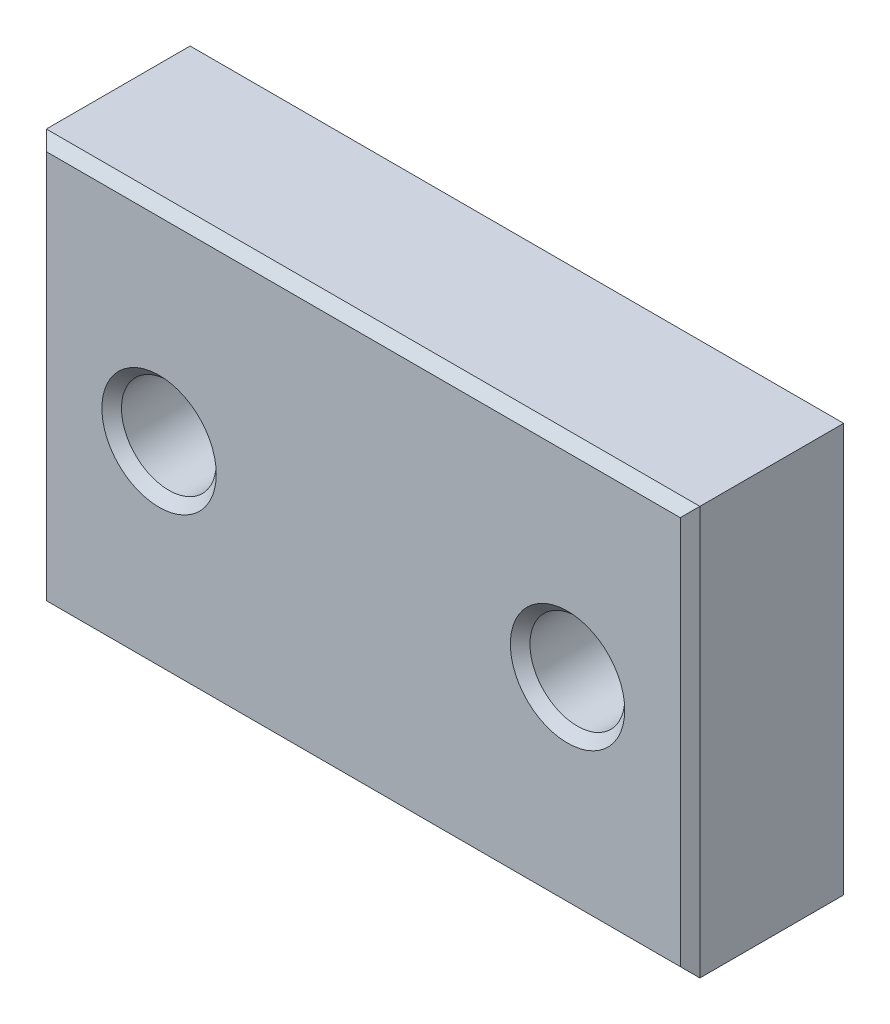
ISO-10303-21;
HEADER;
FILE_DESCRIPTION(('STEP AP214'),'2;1');
FILE_NAME('part.step','',(''),(''),'','','');
FILE_SCHEMA(('AUTOMOTIVE_DESIGN { 1 0 10303 214 1 1 1 1 }'));
ENDSEC;
DATA;
#1=APPLICATION_CONTEXT('core data for automotive mechanical design processes');
#2=APPLICATION_PROTOCOL_DEFINITION('international standard','automotive_design',2000,#1);
#3=PRODUCT_CONTEXT('',#1,'mechanical');
#4=PRODUCT('Part','Part','',(#3));
#5=PRODUCT_RELATED_PRODUCT_CATEGORY('part','',(#4));
#6=PRODUCT_DEFINITION_FORMATION('','',#4);
#7=PRODUCT_DEFINITION_CONTEXT('part definition',#1,'design');
#8=PRODUCT_DEFINITION('design','',#6,#7);
#9=PRODUCT_DEFINITION_SHAPE('','',#8);
#10=(LENGTH_UNIT() NAMED_UNIT(*) SI_UNIT(.MILLI.,.METRE.));
#11=(NAMED_UNIT(*) PLANE_ANGLE_UNIT() SI_UNIT($,.RADIAN.));
#12=(NAMED_UNIT(*) SI_UNIT($,.STERADIAN.) SOLID_ANGLE_UNIT());
#13=UNCERTAINTY_MEASURE_WITH_UNIT(LENGTH_MEASURE(1.E-05),#10,'distance_accuracy_value','');
#14=(GEOMETRIC_REPRESENTATION_CONTEXT(3) GLOBAL_UNCERTAINTY_ASSIGNED_CONTEXT((#13)) GLOBAL_UNIT_ASSIGNED_CONTEXT((#10,
#11,#12)) REPRESENTATION_CONTEXT('',''));
#15=CARTESIAN_POINT('',(0.,0.,0.));
#16=DIRECTION('',(0.,0.,1.));
#17=DIRECTION('',(1.,0.,0.));
#18=AXIS2_PLACEMENT_3D('',#15,#16,#17);
#19=CARTESIAN_POINT('',(12.7,-9.7417824240334,0.));
#20=DIRECTION('',(0.,0.,1.));
#21=DIRECTION('',(1.,0.,0.));
#22=AXIS2_PLACEMENT_3D('',#19,#20,#21);
#23=PLANE('',#22);
#24=CARTESIAN_POINT('',(4.7625,-9.7417824240334,-2.27373675443232E-10));
#25=DIRECTION('',(0.,0.,-1.));
#26=DIRECTION('',(-1.,0.,0.));
#27=AXIS2_PLACEMENT_3D('',#24,#25,#26);
#28=CIRCLE('',#27,2.2224999998155);
#29=CARTESIAN_POINT('',(2.5400000001845,-9.7417824240334,-2.27373675443232E-10));
#30=VERTEX_POINT('',#29);
#31=EDGE_CURVE('E21',#30,#30,#28,.F.);
#32=ORIENTED_EDGE('',*,*,#31,.T.);
#33=EDGE_LOOP('',(#32));
#34=FACE_BOUND('',#33,.T.);
#35=CARTESIAN_POINT('',(20.6375,-9.7417824240334,-1.70530256582424E-10));
#36=DIRECTION('',(0.,0.,-1.));
#37=DIRECTION('',(-1.,0.,0.));
#38=AXIS2_PLACEMENT_3D('',#35,#36,#37);
#39=CIRCLE('',#38,2.22249999975274);
#40=CARTESIAN_POINT('',(18.4150000002473,-9.7417824240334,-1.70530256582424E-10));
#41=VERTEX_POINT('',#40);
#42=EDGE_CURVE('E109',#41,#41,#39,.F.);
#43=ORIENTED_EDGE('',*,*,#42,.T.);
#44=EDGE_LOOP('',(#43));
#45=FACE_BOUND('',#44,.T.);
#46=DIRECTION('',(0.,1.,0.));
#47=VECTOR('',#46,1.);
#48=CARTESIAN_POINT('',(25.019,-5.7730324240334,0.));
#49=LINE('',#48,#47);
#50=CARTESIAN_POINT('',(25.019,-17.2982824240334,0.));
#51=VERTEX_POINT('',#50);
#52=CARTESIAN_POINT('',(25.019,-2.1852824240334,0.));
#53=VERTEX_POINT('',#52);
#54=EDGE_CURVE('E81',#51,#53,#49,.T.);
#55=ORIENTED_EDGE('',*,*,#54,.F.);
#56=DIRECTION('',(1.,0.,0.));
#57=VECTOR('',#56,1.);
#58=CARTESIAN_POINT('',(19.05,-17.2982824240334,0.));
#59=LINE('',#58,#57);
#60=CARTESIAN_POINT('',(0.381,-17.2982824240334,0.));
#61=VERTEX_POINT('',#60);
#62=EDGE_CURVE('E86',#61,#51,#59,.T.);
#63=ORIENTED_EDGE('',*,*,#62,.F.);
#64=DIRECTION('',(0.,1.,0.));
#65=VECTOR('',#64,1.);
#66=CARTESIAN_POINT('',(0.381,-13.7105324240334,0.));
#67=LINE('',#66,#65);
#68=CARTESIAN_POINT('',(0.380999999999999,-2.1852824240334,0.));
#69=VERTEX_POINT('',#68);
#70=EDGE_CURVE('E118',#69,#61,#67,.F.);
#71=ORIENTED_EDGE('',*,*,#70,.F.);
#72=DIRECTION('',(1.,0.,0.));
#73=VECTOR('',#72,1.);
#74=CARTESIAN_POINT('',(6.35,-2.1852824240334,0.));
#75=LINE('',#74,#73);
#76=EDGE_CURVE('E96',#53,#69,#75,.F.);
#77=ORIENTED_EDGE('',*,*,#76,.F.);
#78=EDGE_LOOP('',(#55,#63,#71,#77));
#79=FACE_BOUND('',#78,.T.);
#80=ADVANCED_FACE('F17',(#34,#45,#79),#23,.F.);
#81=CARTESIAN_POINT('',(19.05,-17.4887824240334,0.1905));
#82=DIRECTION('',(0.,-0.707106781186547,-0.707106781186548));
#83=DIRECTION('',(0.,0.707106781186548,-0.707106781186547));
#84=AXIS2_PLACEMENT_3D('',#81,#82,#83);
#85=PLANE('',#84);
#86=ORIENTED_EDGE('',*,*,#62,.T.);
#87=DIRECTION('',(-0.577350269189624,0.577350269189629,-0.577350269189624));
#88=VECTOR('',#87,1.);
#89=CARTESIAN_POINT('',(25.4,-17.6792824240334,0.381));
#90=LINE('',#89,#88);
#91=CARTESIAN_POINT('',(25.4,-17.6792824240334,0.381000000000001));
#92=VERTEX_POINT('',#91);
#93=EDGE_CURVE('E88',#92,#51,#90,.T.);
#94=ORIENTED_EDGE('',*,*,#93,.F.);
#95=DIRECTION('',(1.,0.,0.));
#96=VECTOR('',#95,1.);
#97=CARTESIAN_POINT('',(25.4,-17.6792824240334,0.381));
#98=LINE('',#97,#96);
#99=CARTESIAN_POINT('',(0.,-17.6792824240334,0.381000000000001));
#100=VERTEX_POINT('',#99);
#101=EDGE_CURVE('E111',#100,#92,#98,.T.);
#102=ORIENTED_EDGE('',*,*,#101,.F.);
#103=DIRECTION('',(-0.577350269189625,-0.577350269189629,0.577350269189624));
#104=VECTOR('',#103,1.);
#105=CARTESIAN_POINT('',(0.381,-17.2982824240334,0.));
#106=LINE('',#105,#104);
#107=EDGE_CURVE('E91',#61,#100,#106,.T.);
#108=ORIENTED_EDGE('',*,*,#107,.F.);
#109=EDGE_LOOP('',(#86,#94,#102,#108));
#110=FACE_BOUND('',#109,.T.);
#111=ADVANCED_FACE('F87',(#110),#85,.T.);
#112=CARTESIAN_POINT('',(25.2095,-5.7730324240334,0.1905));
#113=DIRECTION('',(0.707106781186547,0.,-0.707106781186548));
#114=DIRECTION('',(-0.707106781186548,0.,-0.707106781186547));
#115=AXIS2_PLACEMENT_3D('',#112,#113,#114);
#116=PLANE('',#115);
#117=ORIENTED_EDGE('',*,*,#54,.T.);
#118=DIRECTION('',(-0.577350269189625,-0.577350269189627,-0.577350269189626));
#119=VECTOR('',#118,1.);
#120=CARTESIAN_POINT('',(25.4,-1.8042824240334,0.381));
#121=LINE('',#120,#119);
#122=CARTESIAN_POINT('',(25.4,-1.8042824240334,0.381));
#123=VERTEX_POINT('',#122);
#124=EDGE_CURVE('E98',#123,#53,#121,.T.);
#125=ORIENTED_EDGE('',*,*,#124,.F.);
#126=DIRECTION('',(0.,1.,0.));
#127=VECTOR('',#126,1.);
#128=CARTESIAN_POINT('',(25.4,-1.8042824240334,0.381));
#129=LINE('',#128,#127);
#130=EDGE_CURVE('E102',#92,#123,#129,.T.);
#131=ORIENTED_EDGE('',*,*,#130,.F.);
#132=ORIENTED_EDGE('',*,*,#93,.T.);
#133=EDGE_LOOP('',(#117,#125,#131,#132));
#134=FACE_BOUND('',#133,.T.);
#135=ADVANCED_FACE('F100',(#134),#116,.T.);
#136=CARTESIAN_POINT('',(6.35,-1.9947824240334,0.1905));
#137=DIRECTION('',(0.,0.707106781186547,-0.707106781186548));
#138=DIRECTION('',(0.,0.707106781186548,0.707106781186547));
#139=AXIS2_PLACEMENT_3D('',#136,#137,#138);
#140=PLANE('',#139);
#141=ORIENTED_EDGE('',*,*,#76,.T.);
#142=DIRECTION('',(0.577350269189627,-0.577350269189625,-0.577350269189626));
#143=VECTOR('',#142,1.);
#144=CARTESIAN_POINT('',(0.,-1.8042824240334,0.381));
#145=LINE('',#144,#143);
#146=CARTESIAN_POINT('',(0.,-1.8042824240334,0.381));
#147=VERTEX_POINT('',#146);
#148=EDGE_CURVE('E123',#147,#69,#145,.T.);
#149=ORIENTED_EDGE('',*,*,#148,.F.);
#150=DIRECTION('',(1.,0.,0.));
#151=VECTOR('',#150,1.);
#152=CARTESIAN_POINT('',(0.,-1.8042824240334,0.381));
#153=LINE('',#152,#151);
#154=EDGE_CURVE('E133',#123,#147,#153,.F.);
#155=ORIENTED_EDGE('',*,*,#154,.F.);
#156=ORIENTED_EDGE('',*,*,#124,.T.);
#157=EDGE_LOOP('',(#141,#149,#155,#156));
#158=FACE_BOUND('',#157,.T.);
#159=ADVANCED_FACE('F131',(#158),#140,.T.);
#160=CARTESIAN_POINT('',(0.1905,-13.7105324240334,0.1905));
#161=DIRECTION('',(-0.707106781186547,0.,-0.707106781186548));
#162=DIRECTION('',(-0.707106781186548,0.,0.707106781186547));
#163=AXIS2_PLACEMENT_3D('',#160,#161,#162);
#164=PLANE('',#163);
#165=ORIENTED_EDGE('',*,*,#70,.T.);
#166=ORIENTED_EDGE('',*,*,#107,.T.);
#167=DIRECTION('',(0.,1.,0.));
#168=VECTOR('',#167,1.);
#169=CARTESIAN_POINT('',(0.,-17.6792824240334,0.381));
#170=LINE('',#169,#168);
#171=EDGE_CURVE('E149',#147,#100,#170,.F.);
#172=ORIENTED_EDGE('',*,*,#171,.F.);
#173=ORIENTED_EDGE('',*,*,#148,.T.);
#174=EDGE_LOOP('',(#165,#166,#172,#173));
#175=FACE_BOUND('',#174,.T.);
#176=ADVANCED_FACE('F270',(#175),#164,.T.);
#177=CARTESIAN_POINT('',(4.7625,-9.7417824240334,-1.70530256582424E-10));
#178=DIRECTION('',(0.,0.,-1.));
#179=DIRECTION('',(-1.,0.,0.));
#180=AXIS2_PLACEMENT_3D('',#177,#178,#179);
#181=CONICAL_SURFACE('',#180,2.22249999975866,0.785398162502276);
#182=ORIENTED_EDGE('',*,*,#31,.F.);
#183=EDGE_LOOP('',(#182));
#184=FACE_BOUND('',#183,.T.);
#185=CARTESIAN_POINT('',(4.7625,-9.7417824240334,0.381));
#186=DIRECTION('',(0.,0.,1.));
#187=DIRECTION('',(1.,0.,0.));
#188=AXIS2_PLACEMENT_3D('',#185,#186,#187);
#189=CIRCLE('',#188,1.8415);
#190=CARTESIAN_POINT('',(6.604,-9.7417824240334,0.381));
#191=VERTEX_POINT('',#190);
#192=EDGE_CURVE('E160',#191,#191,#189,.T.);
#193=ORIENTED_EDGE('',*,*,#192,.T.);
#194=EDGE_LOOP('',(#193));
#195=FACE_BOUND('',#194,.T.);
#196=ADVANCED_FACE('F273',(#184,#195),#181,.F.);
#197=CARTESIAN_POINT('',(20.6375,-9.7417824240334,-1.70530256582424E-10));
#198=DIRECTION('',(0.,0.,-1.));
#199=DIRECTION('',(-1.,0.,0.));
#200=AXIS2_PLACEMENT_3D('',#197,#198,#199);
#201=CONICAL_SURFACE('',#200,2.22249999975274,0.785398162427679);
#202=ORIENTED_EDGE('',*,*,#42,.F.);
#203=EDGE_LOOP('',(#202));
#204=FACE_BOUND('',#203,.T.);
#205=CARTESIAN_POINT('',(20.6375,-9.7417824240334,0.381));
#206=DIRECTION('',(0.,0.,1.));
#207=DIRECTION('',(1.,0.,0.));
#208=AXIS2_PLACEMENT_3D('',#205,#206,#207);
#209=CIRCLE('',#208,1.8415);
#210=CARTESIAN_POINT('',(22.479,-9.7417824240334,0.381));
#211=VERTEX_POINT('',#210);
#212=EDGE_CURVE('E165',#211,#211,#209,.T.);
#213=ORIENTED_EDGE('',*,*,#212,.T.);
#214=EDGE_LOOP('',(#213));
#215=FACE_BOUND('',#214,.T.);
#216=ADVANCED_FACE('F276',(#204,#215),#201,.F.);
#217=CARTESIAN_POINT('',(25.4,-17.6792824240334,0.));
#218=DIRECTION('',(0.,-1.,0.));
#219=DIRECTION('',(0.,0.,-1.));
#220=AXIS2_PLACEMENT_3D('',#217,#218,#219);
#221=PLANE('',#220);
#222=DIRECTION('',(1.,0.,0.));
#223=VECTOR('',#222,1.);
#224=CARTESIAN_POINT('',(19.05,-17.6792824240334,5.969));
#225=LINE('',#224,#223);
#226=CARTESIAN_POINT('',(0.,-17.6792824240334,5.969));
#227=VERTEX_POINT('',#226);
#228=CARTESIAN_POINT('',(25.4,-17.6792824240334,5.969));
#229=VERTEX_POINT('',#228);
#230=EDGE_CURVE('E170',#227,#229,#225,.T.);
#231=ORIENTED_EDGE('',*,*,#230,.F.);
#232=DIRECTION('',(0.,0.,1.));
#233=VECTOR('',#232,1.);
#234=CARTESIAN_POINT('',(0.,-17.6792824240334,0.));
#235=LINE('',#234,#233);
#236=EDGE_CURVE('E152',#100,#227,#235,.T.);
#237=ORIENTED_EDGE('',*,*,#236,.F.);
#238=ORIENTED_EDGE('',*,*,#101,.T.);
#239=DIRECTION('',(0.,0.,-1.));
#240=VECTOR('',#239,1.);
#241=CARTESIAN_POINT('',(25.4,-17.6792824240334,0.));
#242=LINE('',#241,#240);
#243=EDGE_CURVE('E138',#229,#92,#242,.T.);
#244=ORIENTED_EDGE('',*,*,#243,.F.);
#245=EDGE_LOOP('',(#231,#237,#238,#244));
#246=FACE_BOUND('',#245,.T.);
#247=ADVANCED_FACE('F280',(#246),#221,.T.);
#248=CARTESIAN_POINT('',(25.4,-1.8042824240334,0.));
#249=DIRECTION('',(1.,0.,0.));
#250=DIRECTION('',(0.,0.,-1.));
#251=AXIS2_PLACEMENT_3D('',#248,#249,#250);
#252=PLANE('',#251);
#253=DIRECTION('',(0.,1.,0.));
#254=VECTOR('',#253,1.);
#255=CARTESIAN_POINT('',(25.4,-5.7730324240334,5.969));
#256=LINE('',#255,#254);
#257=CARTESIAN_POINT('',(25.4,-1.8042824240334,5.969));
#258=VERTEX_POINT('',#257);
#259=EDGE_CURVE('E176',#229,#258,#256,.T.);
#260=ORIENTED_EDGE('',*,*,#259,.F.);
#261=ORIENTED_EDGE('',*,*,#243,.T.);
#262=ORIENTED_EDGE('',*,*,#130,.T.);
#263=DIRECTION('',(0.,0.,1.));
#264=VECTOR('',#263,1.);
#265=CARTESIAN_POINT('',(25.4,-1.8042824240334,0.));
#266=LINE('',#265,#264);
#267=EDGE_CURVE('E137',#258,#123,#266,.F.);
#268=ORIENTED_EDGE('',*,*,#267,.F.);
#269=EDGE_LOOP('',(#260,#261,#262,#268));
#270=FACE_BOUND('',#269,.T.);
#271=ADVANCED_FACE('F143',(#270),#252,.T.);
#272=CARTESIAN_POINT('',(0.,-1.8042824240334,0.));
#273=DIRECTION('',(0.,1.,0.));
#274=DIRECTION('',(0.,0.,1.));
#275=AXIS2_PLACEMENT_3D('',#272,#273,#274);
#276=PLANE('',#275);
#277=DIRECTION('',(1.,0.,0.));
#278=VECTOR('',#277,1.);
#279=CARTESIAN_POINT('',(6.35,-1.8042824240334,5.969));
#280=LINE('',#279,#278);
#281=CARTESIAN_POINT('',(0.,-1.8042824240334,5.969));
#282=VERTEX_POINT('',#281);
#283=EDGE_CURVE('E147',#258,#282,#280,.F.);
#284=ORIENTED_EDGE('',*,*,#283,.F.);
#285=ORIENTED_EDGE('',*,*,#267,.T.);
#286=ORIENTED_EDGE('',*,*,#154,.T.);
#287=DIRECTION('',(0.,0.,1.));
#288=VECTOR('',#287,1.);
#289=CARTESIAN_POINT('',(0.,-1.8042824240334,0.));
#290=LINE('',#289,#288);
#291=EDGE_CURVE('E158',#282,#147,#290,.F.);
#292=ORIENTED_EDGE('',*,*,#291,.F.);
#293=EDGE_LOOP('',(#284,#285,#286,#292));
#294=FACE_BOUND('',#293,.T.);
#295=ADVANCED_FACE('F146',(#294),#276,.T.);
#296=CARTESIAN_POINT('',(0.,-17.6792824240334,0.));
#297=DIRECTION('',(-1.,0.,0.));
#298=DIRECTION('',(0.,0.,1.));
#299=AXIS2_PLACEMENT_3D('',#296,#297,#298);
#300=PLANE('',#299);
#301=DIRECTION('',(0.,1.,0.));
#302=VECTOR('',#301,1.);
#303=CARTESIAN_POINT('',(0.,-13.7105324240334,5.969));
#304=LINE('',#303,#302);
#305=EDGE_CURVE('E182',#282,#227,#304,.F.);
#306=ORIENTED_EDGE('',*,*,#305,.F.);
#307=ORIENTED_EDGE('',*,*,#291,.T.);
#308=ORIENTED_EDGE('',*,*,#171,.T.);
#309=ORIENTED_EDGE('',*,*,#236,.T.);
#310=EDGE_LOOP('',(#306,#307,#308,#309));
#311=FACE_BOUND('',#310,.T.);
#312=ADVANCED_FACE('F251',(#311),#300,.T.);
#313=CARTESIAN_POINT('',(4.7625,-9.7417824240334,5.969));
#314=DIRECTION('',(0.,0.,-1.));
#315=DIRECTION('',(-1.,0.,0.));
#316=AXIS2_PLACEMENT_3D('',#313,#314,#315);
#317=CYLINDRICAL_SURFACE('',#316,1.8415);
#318=ORIENTED_EDGE('',*,*,#192,.F.);
#319=EDGE_LOOP('',(#318));
#320=FACE_BOUND('',#319,.T.);
#321=CARTESIAN_POINT('',(4.7625,-9.7417824240334,5.9689999998227));
#322=DIRECTION('',(0.,0.,1.));
#323=DIRECTION('',(-1.,0.,0.));
#324=AXIS2_PLACEMENT_3D('',#321,#322,#323);
#325=CIRCLE('',#324,1.84150000009886);
#326=CARTESIAN_POINT('',(2.92099999990114,-9.7417824240334,5.9689999998227));
#327=VERTEX_POINT('',#326);
#328=EDGE_CURVE('E188',#327,#327,#325,.T.);
#329=ORIENTED_EDGE('',*,*,#328,.T.);
#330=EDGE_LOOP('',(#329));
#331=FACE_BOUND('',#330,.T.);
#332=ADVANCED_FACE('F249',(#320,#331),#317,.F.);
#333=CARTESIAN_POINT('',(20.6375,-9.7417824240334,5.969));
#334=DIRECTION('',(0.,0.,-1.));
#335=DIRECTION('',(-1.,0.,0.));
#336=AXIS2_PLACEMENT_3D('',#333,#334,#335);
#337=CYLINDRICAL_SURFACE('',#336,1.8415);
#338=ORIENTED_EDGE('',*,*,#212,.F.);
#339=EDGE_LOOP('',(#338));
#340=FACE_BOUND('',#339,.T.);
#341=CARTESIAN_POINT('',(20.6375,-9.7417824240334,5.9689999998227));
#342=DIRECTION('',(0.,0.,1.));
#343=DIRECTION('',(-1.,0.,0.));
#344=AXIS2_PLACEMENT_3D('',#341,#342,#343);
#345=CIRCLE('',#344,1.84150000016162);
#346=CARTESIAN_POINT('',(18.7959999998384,-9.7417824240334,5.9689999998227));
#347=VERTEX_POINT('',#346);
#348=EDGE_CURVE('E193',#347,#347,#345,.T.);
#349=ORIENTED_EDGE('',*,*,#348,.T.);
#350=EDGE_LOOP('',(#349));
#351=FACE_BOUND('',#350,.T.);
#352=ADVANCED_FACE('F19',(#340,#351),#337,.F.);
#353=CARTESIAN_POINT('',(19.05,-17.4887824240334,6.1595));
#354=DIRECTION('',(0.,-0.707106781186548,0.707106781186548));
#355=DIRECTION('',(0.,-0.707106781186548,-0.707106781186548));
#356=AXIS2_PLACEMENT_3D('',#353,#354,#355);
#357=PLANE('',#356);
#358=ORIENTED_EDGE('',*,*,#230,.T.);
#359=DIRECTION('',(0.577350269189622,-0.577350269189633,-0.577350269189622));
#360=VECTOR('',#359,1.);
#361=CARTESIAN_POINT('',(25.019,-17.2982824240334,6.35));
#362=LINE('',#361,#360);
#363=CARTESIAN_POINT('',(25.019,-17.2982824240334,6.35));
#364=VERTEX_POINT('',#363);
#365=EDGE_CURVE('E173',#364,#229,#362,.T.);
#366=ORIENTED_EDGE('',*,*,#365,.F.);
#367=DIRECTION('',(1.,0.,0.));
#368=VECTOR('',#367,1.);
#369=CARTESIAN_POINT('',(12.7,-17.2982824240334,6.35));
#370=LINE('',#369,#368);
#371=CARTESIAN_POINT('',(0.380999999999996,-17.2982824240334,6.35));
#372=VERTEX_POINT('',#371);
#373=EDGE_CURVE('E198',#372,#364,#370,.T.);
#374=ORIENTED_EDGE('',*,*,#373,.F.);
#375=DIRECTION('',(0.577350269189625,0.577350269189629,0.577350269189624));
#376=VECTOR('',#375,1.);
#377=CARTESIAN_POINT('',(0.,-17.6792824240334,5.969));
#378=LINE('',#377,#376);
#379=EDGE_CURVE('E185',#227,#372,#378,.T.);
#380=ORIENTED_EDGE('',*,*,#379,.F.);
#381=EDGE_LOOP('',(#358,#366,#374,#380));
#382=FACE_BOUND('',#381,.T.);
#383=ADVANCED_FACE('F215',(#382),#357,.T.);
#384=CARTESIAN_POINT('',(25.2095,-5.7730324240334,6.1595));
#385=DIRECTION('',(0.707106781186548,0.,0.707106781186548));
#386=DIRECTION('',(0.707106781186548,0.,-0.707106781186548));
#387=AXIS2_PLACEMENT_3D('',#384,#385,#386);
#388=PLANE('',#387);
#389=ORIENTED_EDGE('',*,*,#259,.T.);
#390=DIRECTION('',(0.577350269189626,0.577350269189627,-0.577350269189626));
#391=VECTOR('',#390,1.);
#392=CARTESIAN_POINT('',(25.019,-2.1852824240334,6.35));
#393=LINE('',#392,#391);
#394=CARTESIAN_POINT('',(25.019,-2.18528242403339,6.35));
#395=VERTEX_POINT('',#394);
#396=EDGE_CURVE('E178',#395,#258,#393,.T.);
#397=ORIENTED_EDGE('',*,*,#396,.F.);
#398=DIRECTION('',(0.,1.,0.));
#399=VECTOR('',#398,1.);
#400=CARTESIAN_POINT('',(25.019,-9.7417824240334,6.35));
#401=LINE('',#400,#399);
#402=EDGE_CURVE('E201',#364,#395,#401,.T.);
#403=ORIENTED_EDGE('',*,*,#402,.F.);
#404=ORIENTED_EDGE('',*,*,#365,.T.);
#405=EDGE_LOOP('',(#389,#397,#403,#404));
#406=FACE_BOUND('',#405,.T.);
#407=ADVANCED_FACE('F218',(#406),#388,.T.);
#408=CARTESIAN_POINT('',(6.35,-1.9947824240334,6.1595));
#409=DIRECTION('',(0.,0.707106781186548,0.707106781186548));
#410=DIRECTION('',(0.,-0.707106781186548,0.707106781186548));
#411=AXIS2_PLACEMENT_3D('',#408,#409,#410);
#412=PLANE('',#411);
#413=ORIENTED_EDGE('',*,*,#283,.T.);
#414=DIRECTION('',(-0.577350269189627,0.577350269189625,-0.577350269189626));
#415=VECTOR('',#414,1.);
#416=CARTESIAN_POINT('',(0.381,-2.1852824240334,6.35));
#417=LINE('',#416,#415);
#418=CARTESIAN_POINT('',(0.380999999999997,-2.1852824240334,6.35));
#419=VERTEX_POINT('',#418);
#420=EDGE_CURVE('E36',#419,#282,#417,.T.);
#421=ORIENTED_EDGE('',*,*,#420,.F.);
#422=DIRECTION('',(1.,0.,0.));
#423=VECTOR('',#422,1.);
#424=CARTESIAN_POINT('',(12.7,-2.1852824240334,6.35));
#425=LINE('',#424,#423);
#426=EDGE_CURVE('E204',#395,#419,#425,.F.);
#427=ORIENTED_EDGE('',*,*,#426,.F.);
#428=ORIENTED_EDGE('',*,*,#396,.T.);
#429=EDGE_LOOP('',(#413,#421,#427,#428));
#430=FACE_BOUND('',#429,.T.);
#431=ADVANCED_FACE('F219',(#430),#412,.T.);
#432=CARTESIAN_POINT('',(0.1905,-13.7105324240334,6.1595));
#433=DIRECTION('',(-0.707106781186547,0.,0.707106781186548));
#434=DIRECTION('',(0.707106781186548,0.,0.707106781186547));
#435=AXIS2_PLACEMENT_3D('',#432,#433,#434);
#436=PLANE('',#435);
#437=ORIENTED_EDGE('',*,*,#305,.T.);
#438=ORIENTED_EDGE('',*,*,#379,.T.);
#439=DIRECTION('',(0.,1.,0.));
#440=VECTOR('',#439,1.);
#441=CARTESIAN_POINT('',(0.380999999999999,-9.7417824240334,6.35));
#442=LINE('',#441,#440);
#443=EDGE_CURVE('E108',#419,#372,#442,.F.);
#444=ORIENTED_EDGE('',*,*,#443,.F.);
#445=ORIENTED_EDGE('',*,*,#420,.T.);
#446=EDGE_LOOP('',(#437,#438,#444,#445));
#447=FACE_BOUND('',#446,.T.);
#448=ADVANCED_FACE('F211',(#447),#436,.T.);
#449=CARTESIAN_POINT('',(4.7625,-9.7417824240334,6.35000000016817));
#450=DIRECTION('',(0.,0.,1.));
#451=DIRECTION('',(1.,0.,0.));
#452=AXIS2_PLACEMENT_3D('',#449,#450,#451);
#453=CONICAL_SURFACE('',#452,2.22249999970536,0.785398162427679);
#454=CARTESIAN_POINT('',(4.7625,-9.7417824240334,6.35000000022501));
#455=DIRECTION('',(0.,0.,1.));
#456=DIRECTION('',(1.,0.,0.));
#457=AXIS2_PLACEMENT_3D('',#454,#455,#456);
#458=CIRCLE('',#457,2.2224999997622);
#459=CARTESIAN_POINT('',(6.9849999997622,-9.7417824240334,6.35000000022501));
#460=VERTEX_POINT('',#459);
#461=EDGE_CURVE('E27',#460,#460,#458,.F.);
#462=ORIENTED_EDGE('',*,*,#461,.F.);
#463=EDGE_LOOP('',(#462));
#464=FACE_BOUND('',#463,.T.);
#465=ORIENTED_EDGE('',*,*,#328,.F.);
#466=EDGE_LOOP('',(#465));
#467=FACE_BOUND('',#466,.T.);
#468=ADVANCED_FACE('F227',(#464,#467),#453,.F.);
#469=CARTESIAN_POINT('',(20.6375,-9.7417824240334,6.35000000016817));
#470=DIRECTION('',(0.,0.,1.));
#471=DIRECTION('',(1.,0.,0.));
#472=AXIS2_PLACEMENT_3D('',#469,#470,#471);
#473=CONICAL_SURFACE('',#472,2.22249999982496,0.785398162502276);
#474=CARTESIAN_POINT('',(20.6375,-9.7417824240334,6.35000000016817));
#475=DIRECTION('',(0.,0.,1.));
#476=DIRECTION('',(1.,0.,0.));
#477=AXIS2_PLACEMENT_3D('',#474,#475,#476);
#478=CIRCLE('',#477,2.22249999982496);
#479=CARTESIAN_POINT('',(22.859999999825,-9.7417824240334,6.35000000016817));
#480=VERTEX_POINT('',#479);
#481=EDGE_CURVE('E11',#480,#480,#478,.F.);
#482=ORIENTED_EDGE('',*,*,#481,.F.);
#483=EDGE_LOOP('',(#482));
#484=FACE_BOUND('',#483,.T.);
#485=ORIENTED_EDGE('',*,*,#348,.F.);
#486=EDGE_LOOP('',(#485));
#487=FACE_BOUND('',#486,.T.);
#488=ADVANCED_FACE('F231',(#484,#487),#473,.F.);
#489=CARTESIAN_POINT('',(12.7,-9.7417824240334,6.35));
#490=DIRECTION('',(0.,0.,1.));
#491=DIRECTION('',(1.,0.,0.));
#492=AXIS2_PLACEMENT_3D('',#489,#490,#491);
#493=PLANE('',#492);
#494=ORIENTED_EDGE('',*,*,#481,.T.);
#495=EDGE_LOOP('',(#494));
#496=FACE_BOUND('',#495,.T.);
#497=ORIENTED_EDGE('',*,*,#461,.T.);
#498=EDGE_LOOP('',(#497));
#499=FACE_BOUND('',#498,.T.);
#500=ORIENTED_EDGE('',*,*,#426,.T.);
#501=ORIENTED_EDGE('',*,*,#443,.T.);
#502=ORIENTED_EDGE('',*,*,#373,.T.);
#503=ORIENTED_EDGE('',*,*,#402,.T.);
#504=EDGE_LOOP('',(#500,#501,#502,#503));
#505=FACE_BOUND('',#504,.T.);
#506=ADVANCED_FACE('F209',(#496,#499,#505),#493,.T.);
#507=CLOSED_SHELL('',(#80,#111,#135,#159,#176,#196,#216,#247,#271,#295,#312,#332,#352,#383,#407,
#431,#448,#468,#488,#506));
#508=MANIFOLD_SOLID_BREP('B1',#507);
#509=ADVANCED_BREP_SHAPE_REPRESENTATION('',(#18,#508),#14);
#510=SHAPE_DEFINITION_REPRESENTATION(#9,#509);
ENDSEC;
END-ISO-10303-21;
